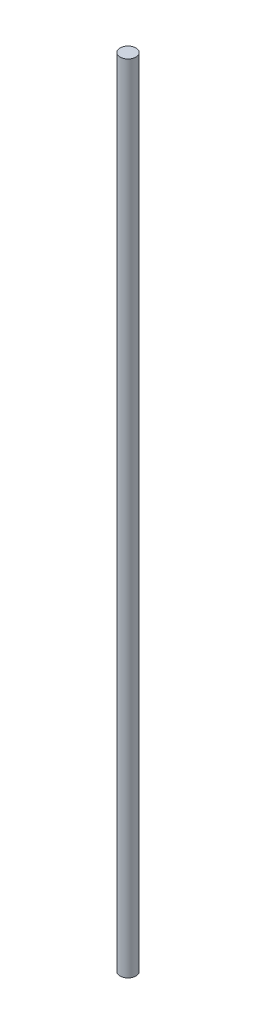
ISO-10303-21;
HEADER;
FILE_DESCRIPTION(('STEP AP214'),'2;1');
FILE_NAME('part.step','',(''),(''),'','','');
FILE_SCHEMA(('AUTOMOTIVE_DESIGN { 1 0 10303 214 1 1 1 1 }'));
ENDSEC;
DATA;
#1=APPLICATION_CONTEXT('core data for automotive mechanical design processes');
#2=APPLICATION_PROTOCOL_DEFINITION('international standard','automotive_design',2000,#1);
#3=PRODUCT_CONTEXT('',#1,'mechanical');
#4=PRODUCT('Part','Part','',(#3));
#5=PRODUCT_RELATED_PRODUCT_CATEGORY('part','',(#4));
#6=PRODUCT_DEFINITION_FORMATION('','',#4);
#7=PRODUCT_DEFINITION_CONTEXT('part definition',#1,'design');
#8=PRODUCT_DEFINITION('design','',#6,#7);
#9=PRODUCT_DEFINITION_SHAPE('','',#8);
#10=(LENGTH_UNIT() NAMED_UNIT(*) SI_UNIT(.MILLI.,.METRE.));
#11=(NAMED_UNIT(*) PLANE_ANGLE_UNIT() SI_UNIT($,.RADIAN.));
#12=(NAMED_UNIT(*) SI_UNIT($,.STERADIAN.) SOLID_ANGLE_UNIT());
#13=UNCERTAINTY_MEASURE_WITH_UNIT(LENGTH_MEASURE(1.E-05),#10,'distance_accuracy_value','');
#14=(GEOMETRIC_REPRESENTATION_CONTEXT(3) GLOBAL_UNCERTAINTY_ASSIGNED_CONTEXT((#13)) GLOBAL_UNIT_ASSIGNED_CONTEXT((#10,
#11,#12)) REPRESENTATION_CONTEXT('',''));
#15=CARTESIAN_POINT('',(0.,0.,0.));
#16=DIRECTION('',(0.,0.,1.));
#17=DIRECTION('',(1.,0.,0.));
#18=AXIS2_PLACEMENT_3D('',#15,#16,#17);
#19=CARTESIAN_POINT('',(0.,400.,0.));
#20=DIRECTION('',(0.,-1.,0.));
#21=DIRECTION('',(0.,0.,-1.));
#22=AXIS2_PLACEMENT_3D('',#19,#20,#21);
#23=CYLINDRICAL_SURFACE('',#22,4.);
#24=CARTESIAN_POINT('',(0.,400.,0.));
#25=DIRECTION('',(0.,1.,0.));
#26=DIRECTION('',(0.,0.,1.));
#27=AXIS2_PLACEMENT_3D('',#24,#25,#26);
#28=CIRCLE('',#27,4.);
#29=CARTESIAN_POINT('',(0.,400.,4.));
#30=VERTEX_POINT('',#29);
#31=EDGE_CURVE('E10',#30,#30,#28,.T.);
#32=ORIENTED_EDGE('',*,*,#31,.F.);
#33=EDGE_LOOP('',(#32));
#34=FACE_BOUND('',#33,.T.);
#35=CARTESIAN_POINT('',(0.,0.,0.));
#36=DIRECTION('',(0.,1.,0.));
#37=DIRECTION('',(0.,0.,1.));
#38=AXIS2_PLACEMENT_3D('',#35,#36,#37);
#39=CIRCLE('',#38,4.);
#40=CARTESIAN_POINT('',(0.,0.,4.));
#41=VERTEX_POINT('',#40);
#42=EDGE_CURVE('E40',#41,#41,#39,.T.);
#43=ORIENTED_EDGE('',*,*,#42,.T.);
#44=EDGE_LOOP('',(#43));
#45=FACE_BOUND('',#44,.T.);
#46=ADVANCED_FACE('F37',(#34,#45),#23,.T.);
#47=CARTESIAN_POINT('',(0.,400.,0.));
#48=DIRECTION('',(0.,1.,0.));
#49=DIRECTION('',(0.,0.,1.));
#50=AXIS2_PLACEMENT_3D('',#47,#48,#49);
#51=PLANE('',#50);
#52=ORIENTED_EDGE('',*,*,#31,.T.);
#53=EDGE_LOOP('',(#52));
#54=FACE_BOUND('',#53,.T.);
#55=ADVANCED_FACE('F52',(#54),#51,.T.);
#56=CARTESIAN_POINT('',(0.,0.,0.));
#57=DIRECTION('',(0.,1.,0.));
#58=DIRECTION('',(0.,0.,1.));
#59=AXIS2_PLACEMENT_3D('',#56,#57,#58);
#60=PLANE('',#59);
#61=ORIENTED_EDGE('',*,*,#42,.F.);
#62=EDGE_LOOP('',(#61));
#63=FACE_BOUND('',#62,.T.);
#64=ADVANCED_FACE('F50',(#63),#60,.F.);
#65=CLOSED_SHELL('',(#46,#55,#64));
#66=MANIFOLD_SOLID_BREP('B2',#65);
#67=ADVANCED_BREP_SHAPE_REPRESENTATION('',(#18,#66),#14);
#68=SHAPE_DEFINITION_REPRESENTATION(#9,#67);
ENDSEC;
END-ISO-10303-21;
